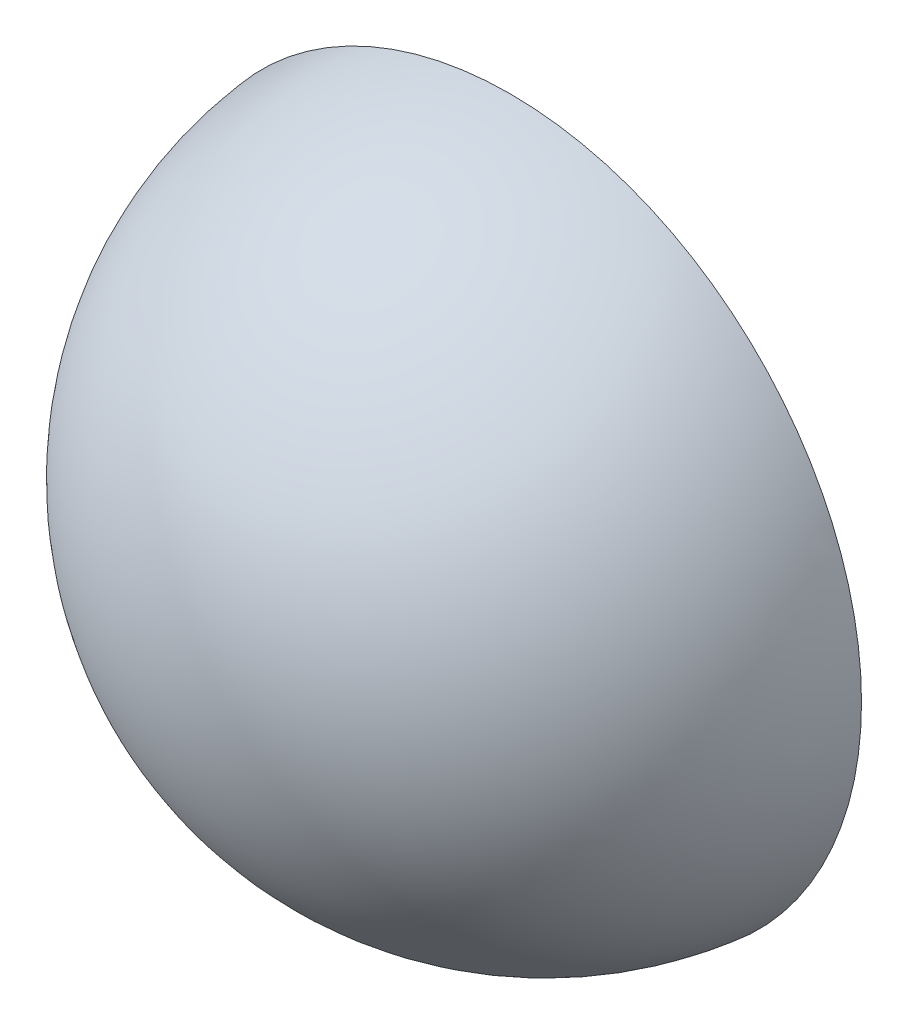
ISO-10303-21;
HEADER;
FILE_DESCRIPTION(('STEP AP214'),'2;1');
FILE_NAME('part.step','',(''),(''),'','','');
FILE_SCHEMA(('AUTOMOTIVE_DESIGN { 1 0 10303 214 1 1 1 1 }'));
ENDSEC;
DATA;
#1=APPLICATION_CONTEXT('core data for automotive mechanical design processes');
#2=APPLICATION_PROTOCOL_DEFINITION('international standard','automotive_design',2000,#1);
#3=PRODUCT_CONTEXT('',#1,'mechanical');
#4=PRODUCT('Part','Part','',(#3));
#5=PRODUCT_RELATED_PRODUCT_CATEGORY('part','',(#4));
#6=PRODUCT_DEFINITION_FORMATION('','',#4);
#7=PRODUCT_DEFINITION_CONTEXT('part definition',#1,'design');
#8=PRODUCT_DEFINITION('design','',#6,#7);
#9=PRODUCT_DEFINITION_SHAPE('','',#8);
#10=(LENGTH_UNIT() NAMED_UNIT(*) SI_UNIT(.MILLI.,.METRE.));
#11=(NAMED_UNIT(*) PLANE_ANGLE_UNIT() SI_UNIT($,.RADIAN.));
#12=(NAMED_UNIT(*) SI_UNIT($,.STERADIAN.) SOLID_ANGLE_UNIT());
#13=UNCERTAINTY_MEASURE_WITH_UNIT(LENGTH_MEASURE(1.E-05),#10,'distance_accuracy_value','');
#14=(GEOMETRIC_REPRESENTATION_CONTEXT(3) GLOBAL_UNCERTAINTY_ASSIGNED_CONTEXT((#13)) GLOBAL_UNIT_ASSIGNED_CONTEXT((#10,
#11,#12)) REPRESENTATION_CONTEXT('',''));
#15=CARTESIAN_POINT('',(0.,0.,0.));
#16=DIRECTION('',(0.,0.,1.));
#17=DIRECTION('',(1.,0.,0.));
#18=AXIS2_PLACEMENT_3D('',#15,#16,#17);
#19=CARTESIAN_POINT('',(0.,0.,0.01));
#20=DIRECTION('',(0.,0.,1.));
#21=DIRECTION('',(1.,0.,0.));
#22=AXIS2_PLACEMENT_3D('',#19,#20,#21);
#23=PLANE('',#22);
#24=CARTESIAN_POINT('',(0.,0.,0.01));
#25=DIRECTION('',(0.,0.,1.));
#26=DIRECTION('',(0.,1.,0.));
#27=AXIS2_PLACEMENT_3D('',#24,#25,#26);
#28=CIRCLE('',#27,0.099498743710662);
#29=CARTESIAN_POINT('',(0.,-0.099498743710662,0.01));
#30=VERTEX_POINT('',#29);
#31=CARTESIAN_POINT('',(-0.099498743710662,0.,0.01));
#32=VERTEX_POINT('',#31);
#33=EDGE_CURVE('E11',#30,#32,#28,.T.);
#34=ORIENTED_EDGE('',*,*,#33,.F.);
#35=CARTESIAN_POINT('',(0.,0.,0.01));
#36=DIRECTION('',(0.,0.,1.));
#37=DIRECTION('',(0.,1.,0.));
#38=AXIS2_PLACEMENT_3D('',#35,#36,#37);
#39=CIRCLE('',#38,0.099498743710662);
#40=EDGE_CURVE('E24',#32,#30,#39,.T.);
#41=ORIENTED_EDGE('',*,*,#40,.F.);
#42=EDGE_LOOP('',(#34,#41));
#43=FACE_BOUND('',#42,.T.);
#44=ADVANCED_FACE('F17',(#43),#23,.F.);
#45=CARTESIAN_POINT('',(0.,0.,0.));
#46=DIRECTION('',(0.,0.,1.));
#47=DIRECTION('',(1.,0.,0.));
#48=AXIS2_PLACEMENT_3D('',#45,#46,#47);
#49=SPHERICAL_SURFACE('',#48,0.1);
#50=ORIENTED_EDGE('',*,*,#33,.T.);
#51=CARTESIAN_POINT('',(0.,0.,0.));
#52=DIRECTION('',(0.,-1.,0.));
#53=DIRECTION('',(-1.,0.,0.));
#54=AXIS2_PLACEMENT_3D('',#51,#52,#53);
#55=CIRCLE('',#54,0.1);
#56=CARTESIAN_POINT('',(0.,0.,0.1));
#57=VERTEX_POINT('',#56);
#58=EDGE_CURVE('E35',#57,#32,#55,.T.);
#59=ORIENTED_EDGE('',*,*,#58,.F.);
#60=ORIENTED_EDGE('',*,*,#58,.T.);
#61=ORIENTED_EDGE('',*,*,#40,.T.);
#62=EDGE_LOOP('',(#50,#59,#60,#61));
#63=FACE_BOUND('',#62,.T.);
#64=ADVANCED_FACE('F36',(#63),#49,.T.);
#65=CLOSED_SHELL('',(#44,#64));
#66=MANIFOLD_SOLID_BREP('B1',#65);
#67=ADVANCED_BREP_SHAPE_REPRESENTATION('',(#18,#66),#14);
#68=SHAPE_DEFINITION_REPRESENTATION(#9,#67);
ENDSEC;
END-ISO-10303-21;
